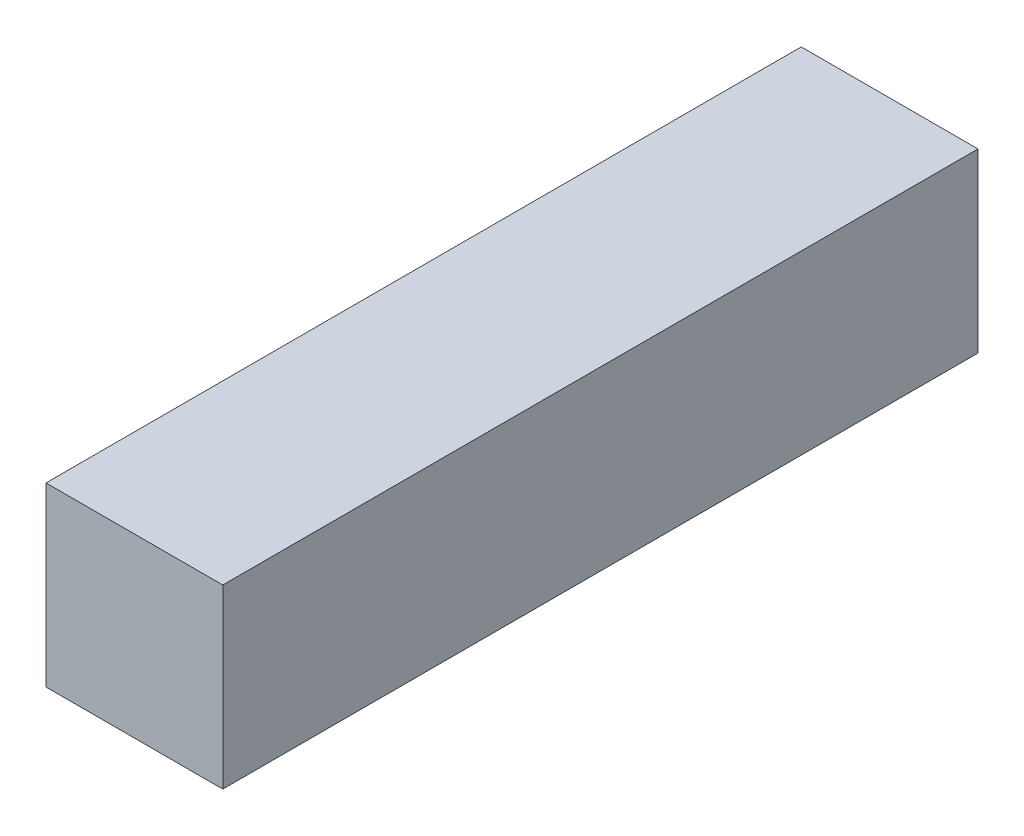
ISO-10303-21;
HEADER;
FILE_DESCRIPTION(('STEP AP214'),'2;1');
FILE_NAME('part.step','',(''),(''),'','','');
FILE_SCHEMA(('AUTOMOTIVE_DESIGN { 1 0 10303 214 1 1 1 1 }'));
ENDSEC;
DATA;
#1=APPLICATION_CONTEXT('core data for automotive mechanical design processes');
#2=APPLICATION_PROTOCOL_DEFINITION('international standard','automotive_design',2000,#1);
#3=PRODUCT_CONTEXT('',#1,'mechanical');
#4=PRODUCT('Part','Part','',(#3));
#5=PRODUCT_RELATED_PRODUCT_CATEGORY('part','',(#4));
#6=PRODUCT_DEFINITION_FORMATION('','',#4);
#7=PRODUCT_DEFINITION_CONTEXT('part definition',#1,'design');
#8=PRODUCT_DEFINITION('design','',#6,#7);
#9=PRODUCT_DEFINITION_SHAPE('','',#8);
#10=(LENGTH_UNIT() NAMED_UNIT(*) SI_UNIT(.MILLI.,.METRE.));
#11=(NAMED_UNIT(*) PLANE_ANGLE_UNIT() SI_UNIT($,.RADIAN.));
#12=(NAMED_UNIT(*) SI_UNIT($,.STERADIAN.) SOLID_ANGLE_UNIT());
#13=UNCERTAINTY_MEASURE_WITH_UNIT(LENGTH_MEASURE(1.E-05),#10,'distance_accuracy_value','');
#14=(GEOMETRIC_REPRESENTATION_CONTEXT(3) GLOBAL_UNCERTAINTY_ASSIGNED_CONTEXT((#13)) GLOBAL_UNIT_ASSIGNED_CONTEXT((#10,
#11,#12)) REPRESENTATION_CONTEXT('',''));
#15=CARTESIAN_POINT('',(0.,0.,0.));
#16=DIRECTION('',(0.,0.,1.));
#17=DIRECTION('',(1.,0.,0.));
#18=AXIS2_PLACEMENT_3D('',#15,#16,#17);
#19=CARTESIAN_POINT('',(13.95,27.9,-59.6));
#20=DIRECTION('',(-1.,0.,0.));
#21=DIRECTION('',(0.,0.,1.));
#22=AXIS2_PLACEMENT_3D('',#19,#20,#21);
#23=PLANE('',#22);
#24=DIRECTION('',(0.,0.,-1.));
#25=VECTOR('',#24,1.);
#26=CARTESIAN_POINT('',(13.95,0.,-59.6));
#27=LINE('',#26,#25);
#28=CARTESIAN_POINT('',(13.95,0.,59.6));
#29=VERTEX_POINT('',#28);
#30=CARTESIAN_POINT('',(13.95,0.,-59.6));
#31=VERTEX_POINT('',#30);
#32=EDGE_CURVE('E98',#29,#31,#27,.T.);
#33=ORIENTED_EDGE('',*,*,#32,.T.);
#34=DIRECTION('',(0.,-1.,0.));
#35=VECTOR('',#34,1.);
#36=CARTESIAN_POINT('',(13.95,27.9,-59.6));
#37=LINE('',#36,#35);
#38=CARTESIAN_POINT('',(13.95,27.9,-59.6));
#39=VERTEX_POINT('',#38);
#40=EDGE_CURVE('E11',#39,#31,#37,.T.);
#41=ORIENTED_EDGE('',*,*,#40,.F.);
#42=DIRECTION('',(0.,0.,-1.));
#43=VECTOR('',#42,1.);
#44=CARTESIAN_POINT('',(13.95,27.9,-59.6));
#45=LINE('',#44,#43);
#46=CARTESIAN_POINT('',(13.95,27.9,59.6));
#47=VERTEX_POINT('',#46);
#48=EDGE_CURVE('E86',#47,#39,#45,.T.);
#49=ORIENTED_EDGE('',*,*,#48,.F.);
#50=DIRECTION('',(0.,-1.,0.));
#51=VECTOR('',#50,1.);
#52=CARTESIAN_POINT('',(13.95,27.9,59.6));
#53=LINE('',#52,#51);
#54=EDGE_CURVE('E94',#47,#29,#53,.T.);
#55=ORIENTED_EDGE('',*,*,#54,.T.);
#56=EDGE_LOOP('',(#33,#41,#49,#55));
#57=FACE_BOUND('',#56,.T.);
#58=ADVANCED_FACE('F35',(#57),#23,.F.);
#59=CARTESIAN_POINT('',(-13.95,27.9,-59.6));
#60=DIRECTION('',(0.,0.,1.));
#61=DIRECTION('',(1.,0.,0.));
#62=AXIS2_PLACEMENT_3D('',#59,#60,#61);
#63=PLANE('',#62);
#64=DIRECTION('',(-1.,0.,0.));
#65=VECTOR('',#64,1.);
#66=CARTESIAN_POINT('',(-13.95,0.,-59.6));
#67=LINE('',#66,#65);
#68=CARTESIAN_POINT('',(-13.95,0.,-59.6));
#69=VERTEX_POINT('',#68);
#70=EDGE_CURVE('E90',#31,#69,#67,.T.);
#71=ORIENTED_EDGE('',*,*,#70,.T.);
#72=DIRECTION('',(0.,-1.,0.));
#73=VECTOR('',#72,1.);
#74=CARTESIAN_POINT('',(-13.95,27.9,-59.6));
#75=LINE('',#74,#73);
#76=CARTESIAN_POINT('',(-13.95,27.9,-59.6));
#77=VERTEX_POINT('',#76);
#78=EDGE_CURVE('E43',#77,#69,#75,.T.);
#79=ORIENTED_EDGE('',*,*,#78,.F.);
#80=DIRECTION('',(-1.,0.,0.));
#81=VECTOR('',#80,1.);
#82=CARTESIAN_POINT('',(-13.95,27.9,-59.6));
#83=LINE('',#82,#81);
#84=EDGE_CURVE('E81',#39,#77,#83,.T.);
#85=ORIENTED_EDGE('',*,*,#84,.F.);
#86=ORIENTED_EDGE('',*,*,#40,.T.);
#87=EDGE_LOOP('',(#71,#79,#85,#86));
#88=FACE_BOUND('',#87,.T.);
#89=ADVANCED_FACE('F89',(#88),#63,.F.);
#90=CARTESIAN_POINT('',(-13.95,27.9,-59.6));
#91=DIRECTION('',(1.,0.,0.));
#92=DIRECTION('',(0.,0.,-1.));
#93=AXIS2_PLACEMENT_3D('',#90,#91,#92);
#94=PLANE('',#93);
#95=DIRECTION('',(0.,0.,1.));
#96=VECTOR('',#95,1.);
#97=CARTESIAN_POINT('',(-13.95,0.,-59.6));
#98=LINE('',#97,#96);
#99=CARTESIAN_POINT('',(-13.95,0.,59.6));
#100=VERTEX_POINT('',#99);
#101=EDGE_CURVE('E68',#69,#100,#98,.T.);
#102=ORIENTED_EDGE('',*,*,#101,.T.);
#103=DIRECTION('',(0.,-1.,0.));
#104=VECTOR('',#103,1.);
#105=CARTESIAN_POINT('',(-13.95,27.9,59.6));
#106=LINE('',#105,#104);
#107=CARTESIAN_POINT('',(-13.95,27.9,59.6));
#108=VERTEX_POINT('',#107);
#109=EDGE_CURVE('E91',#108,#100,#106,.T.);
#110=ORIENTED_EDGE('',*,*,#109,.F.);
#111=DIRECTION('',(0.,0.,1.));
#112=VECTOR('',#111,1.);
#113=CARTESIAN_POINT('',(-13.95,27.9,-59.6));
#114=LINE('',#113,#112);
#115=EDGE_CURVE('E84',#77,#108,#114,.T.);
#116=ORIENTED_EDGE('',*,*,#115,.F.);
#117=ORIENTED_EDGE('',*,*,#78,.T.);
#118=EDGE_LOOP('',(#102,#110,#116,#117));
#119=FACE_BOUND('',#118,.T.);
#120=ADVANCED_FACE('F92',(#119),#94,.F.);
#121=CARTESIAN_POINT('',(-13.95,27.9,59.6));
#122=DIRECTION('',(0.,0.,-1.));
#123=DIRECTION('',(-1.,0.,0.));
#124=AXIS2_PLACEMENT_3D('',#121,#122,#123);
#125=PLANE('',#124);
#126=DIRECTION('',(1.,0.,0.));
#127=VECTOR('',#126,1.);
#128=CARTESIAN_POINT('',(-13.95,0.,59.6));
#129=LINE('',#128,#127);
#130=EDGE_CURVE('E74',#100,#29,#129,.T.);
#131=ORIENTED_EDGE('',*,*,#130,.T.);
#132=ORIENTED_EDGE('',*,*,#54,.F.);
#133=DIRECTION('',(1.,0.,0.));
#134=VECTOR('',#133,1.);
#135=CARTESIAN_POINT('',(-13.95,27.9,59.6));
#136=LINE('',#135,#134);
#137=EDGE_CURVE('E51',#108,#47,#136,.T.);
#138=ORIENTED_EDGE('',*,*,#137,.F.);
#139=ORIENTED_EDGE('',*,*,#109,.T.);
#140=EDGE_LOOP('',(#131,#132,#138,#139));
#141=FACE_BOUND('',#140,.T.);
#142=ADVANCED_FACE('F105',(#141),#125,.F.);
#143=CARTESIAN_POINT('',(0.,27.9,0.));
#144=DIRECTION('',(0.,1.,0.));
#145=DIRECTION('',(0.,0.,1.));
#146=AXIS2_PLACEMENT_3D('',#143,#144,#145);
#147=PLANE('',#146);
#148=ORIENTED_EDGE('',*,*,#48,.T.);
#149=ORIENTED_EDGE('',*,*,#84,.T.);
#150=ORIENTED_EDGE('',*,*,#115,.T.);
#151=ORIENTED_EDGE('',*,*,#137,.T.);
#152=EDGE_LOOP('',(#148,#149,#150,#151));
#153=FACE_BOUND('',#152,.T.);
#154=ADVANCED_FACE('F82',(#153),#147,.T.);
#155=CARTESIAN_POINT('',(0.,0.,0.));
#156=DIRECTION('',(0.,1.,0.));
#157=DIRECTION('',(0.,0.,1.));
#158=AXIS2_PLACEMENT_3D('',#155,#156,#157);
#159=PLANE('',#158);
#160=ORIENTED_EDGE('',*,*,#32,.F.);
#161=ORIENTED_EDGE('',*,*,#130,.F.);
#162=ORIENTED_EDGE('',*,*,#101,.F.);
#163=ORIENTED_EDGE('',*,*,#70,.F.);
#164=EDGE_LOOP('',(#160,#161,#162,#163));
#165=FACE_BOUND('',#164,.T.);
#166=ADVANCED_FACE('F108',(#165),#159,.F.);
#167=CLOSED_SHELL('',(#58,#89,#120,#142,#154,#166));
#168=MANIFOLD_SOLID_BREP('B2',#167);
#169=ADVANCED_BREP_SHAPE_REPRESENTATION('',(#18,#168),#14);
#170=SHAPE_DEFINITION_REPRESENTATION(#9,#169);
ENDSEC;
END-ISO-10303-21;
